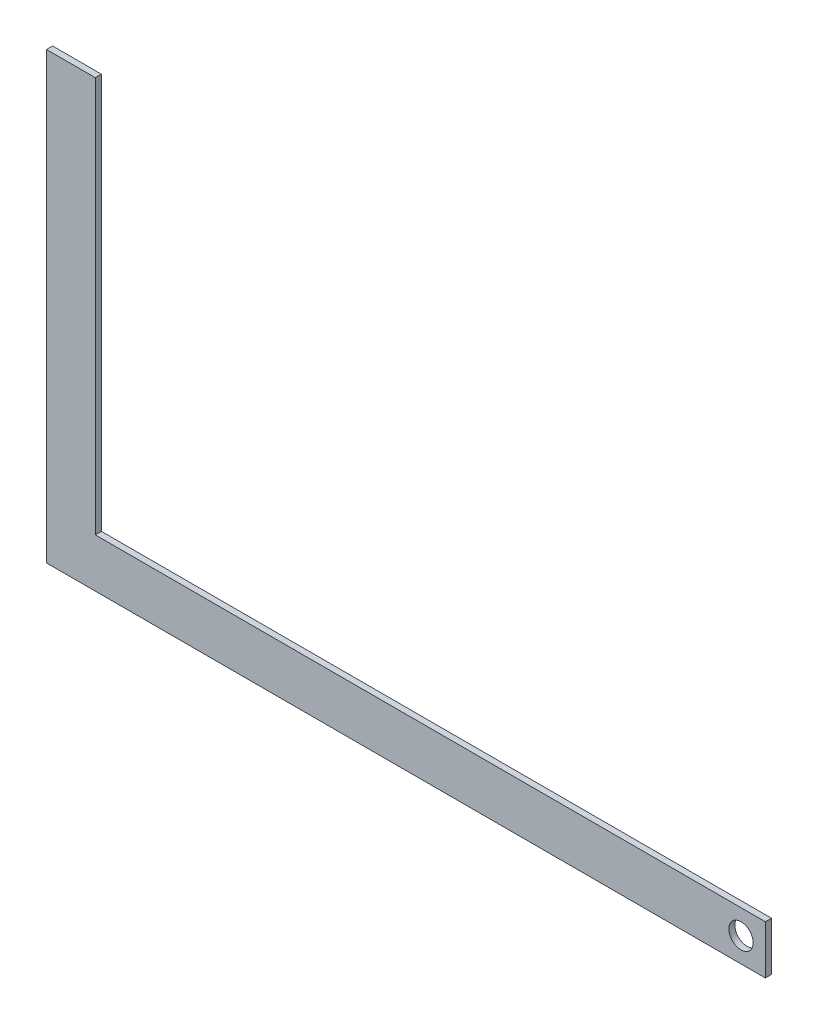
ISO-10303-21;
HEADER;
FILE_DESCRIPTION(('STEP AP214'),'2;1');
FILE_NAME('part.step','',(''),(''),'','','');
FILE_SCHEMA(('AUTOMOTIVE_DESIGN { 1 0 10303 214 1 1 1 1 }'));
ENDSEC;
DATA;
#1=APPLICATION_CONTEXT('core data for automotive mechanical design processes');
#2=APPLICATION_PROTOCOL_DEFINITION('international standard','automotive_design',2000,#1);
#3=PRODUCT_CONTEXT('',#1,'mechanical');
#4=PRODUCT('Part','Part','',(#3));
#5=PRODUCT_RELATED_PRODUCT_CATEGORY('part','',(#4));
#6=PRODUCT_DEFINITION_FORMATION('','',#4);
#7=PRODUCT_DEFINITION_CONTEXT('part definition',#1,'design');
#8=PRODUCT_DEFINITION('design','',#6,#7);
#9=PRODUCT_DEFINITION_SHAPE('','',#8);
#10=(LENGTH_UNIT() NAMED_UNIT(*) SI_UNIT(.MILLI.,.METRE.));
#11=(NAMED_UNIT(*) PLANE_ANGLE_UNIT() SI_UNIT($,.RADIAN.));
#12=(NAMED_UNIT(*) SI_UNIT($,.STERADIAN.) SOLID_ANGLE_UNIT());
#13=UNCERTAINTY_MEASURE_WITH_UNIT(LENGTH_MEASURE(1.E-05),#10,'distance_accuracy_value','');
#14=(GEOMETRIC_REPRESENTATION_CONTEXT(3) GLOBAL_UNCERTAINTY_ASSIGNED_CONTEXT((#13)) GLOBAL_UNIT_ASSIGNED_CONTEXT((#10,
#11,#12)) REPRESENTATION_CONTEXT('',''));
#15=CARTESIAN_POINT('',(0.,0.,0.));
#16=DIRECTION('',(0.,0.,1.));
#17=DIRECTION('',(1.,0.,0.));
#18=AXIS2_PLACEMENT_3D('',#15,#16,#17);
#19=CARTESIAN_POINT('',(0.,0.,3.175));
#20=DIRECTION('',(0.,0.,-1.));
#21=DIRECTION('',(-1.,0.,0.));
#22=AXIS2_PLACEMENT_3D('',#19,#20,#21);
#23=PLANE('',#22);
#24=DIRECTION('',(0.,-1.,0.));
#25=VECTOR('',#24,1.);
#26=CARTESIAN_POINT('',(0.,0.,3.175));
#27=LINE('',#26,#25);
#28=CARTESIAN_POINT('',(0.,231.775,3.175));
#29=VERTEX_POINT('',#28);
#30=CARTESIAN_POINT('',(0.,0.,3.175));
#31=VERTEX_POINT('',#30);
#32=EDGE_CURVE('E114',#29,#31,#27,.T.);
#33=ORIENTED_EDGE('',*,*,#32,.T.);
#34=DIRECTION('',(1.,0.,0.));
#35=VECTOR('',#34,1.);
#36=CARTESIAN_POINT('',(0.,0.,3.175));
#37=LINE('',#36,#35);
#38=CARTESIAN_POINT('',(374.65,0.,3.175));
#39=VERTEX_POINT('',#38);
#40=EDGE_CURVE('E78',#31,#39,#37,.T.);
#41=ORIENTED_EDGE('',*,*,#40,.T.);
#42=DIRECTION('',(0.,1.,0.));
#43=VECTOR('',#42,1.);
#44=CARTESIAN_POINT('',(374.65,0.,3.175));
#45=LINE('',#44,#43);
#46=CARTESIAN_POINT('',(374.65,25.4,3.175));
#47=VERTEX_POINT('',#46);
#48=EDGE_CURVE('E56',#39,#47,#45,.T.);
#49=ORIENTED_EDGE('',*,*,#48,.T.);
#50=DIRECTION('',(-1.,0.,0.));
#51=VECTOR('',#50,1.);
#52=CARTESIAN_POINT('',(0.,25.4,3.175));
#53=LINE('',#52,#51);
#54=CARTESIAN_POINT('',(25.4,25.4,3.175));
#55=VERTEX_POINT('',#54);
#56=EDGE_CURVE('E121',#47,#55,#53,.T.);
#57=ORIENTED_EDGE('',*,*,#56,.T.);
#58=DIRECTION('',(0.,1.,0.));
#59=VECTOR('',#58,1.);
#60=CARTESIAN_POINT('',(25.4,25.4,3.175));
#61=LINE('',#60,#59);
#62=CARTESIAN_POINT('',(25.4,231.775,3.175));
#63=VERTEX_POINT('',#62);
#64=EDGE_CURVE('E47',#55,#63,#61,.T.);
#65=ORIENTED_EDGE('',*,*,#64,.T.);
#66=DIRECTION('',(-1.,0.,0.));
#67=VECTOR('',#66,1.);
#68=CARTESIAN_POINT('',(0.,231.775,3.175));
#69=LINE('',#68,#67);
#70=EDGE_CURVE('E110',#63,#29,#69,.T.);
#71=ORIENTED_EDGE('',*,*,#70,.T.);
#72=EDGE_LOOP('',(#33,#41,#49,#57,#65,#71));
#73=FACE_BOUND('',#72,.T.);
#74=CARTESIAN_POINT('',(361.95,12.7,3.175));
#75=DIRECTION('',(0.,0.,1.));
#76=DIRECTION('',(1.,0.,0.));
#77=AXIS2_PLACEMENT_3D('',#74,#75,#76);
#78=CIRCLE('',#77,6.35);
#79=CARTESIAN_POINT('',(368.3,12.7,3.175));
#80=VERTEX_POINT('',#79);
#81=EDGE_CURVE('E131',#80,#80,#78,.T.);
#82=ORIENTED_EDGE('',*,*,#81,.F.);
#83=EDGE_LOOP('',(#82));
#84=FACE_BOUND('',#83,.T.);
#85=ADVANCED_FACE('F32',(#73,#84),#23,.F.);
#86=CARTESIAN_POINT('',(0.,0.,0.));
#87=DIRECTION('',(0.,0.,-1.));
#88=DIRECTION('',(-1.,0.,0.));
#89=AXIS2_PLACEMENT_3D('',#86,#87,#88);
#90=PLANE('',#89);
#91=DIRECTION('',(0.,-1.,0.));
#92=VECTOR('',#91,1.);
#93=CARTESIAN_POINT('',(0.,0.,0.));
#94=LINE('',#93,#92);
#95=CARTESIAN_POINT('',(0.,231.775,0.));
#96=VERTEX_POINT('',#95);
#97=CARTESIAN_POINT('',(0.,0.,0.));
#98=VERTEX_POINT('',#97);
#99=EDGE_CURVE('E124',#96,#98,#94,.T.);
#100=ORIENTED_EDGE('',*,*,#99,.F.);
#101=DIRECTION('',(-1.,0.,0.));
#102=VECTOR('',#101,1.);
#103=CARTESIAN_POINT('',(0.,231.775,0.));
#104=LINE('',#103,#102);
#105=CARTESIAN_POINT('',(25.4,231.775,0.));
#106=VERTEX_POINT('',#105);
#107=EDGE_CURVE('E102',#106,#96,#104,.T.);
#108=ORIENTED_EDGE('',*,*,#107,.F.);
#109=DIRECTION('',(0.,1.,0.));
#110=VECTOR('',#109,1.);
#111=CARTESIAN_POINT('',(25.4,25.4,0.));
#112=LINE('',#111,#110);
#113=CARTESIAN_POINT('',(25.4,25.4,0.));
#114=VERTEX_POINT('',#113);
#115=EDGE_CURVE('E96',#114,#106,#112,.T.);
#116=ORIENTED_EDGE('',*,*,#115,.F.);
#117=DIRECTION('',(-1.,0.,0.));
#118=VECTOR('',#117,1.);
#119=CARTESIAN_POINT('',(0.,25.4,0.));
#120=LINE('',#119,#118);
#121=CARTESIAN_POINT('',(374.65,25.4,0.));
#122=VERTEX_POINT('',#121);
#123=EDGE_CURVE('E108',#122,#114,#120,.T.);
#124=ORIENTED_EDGE('',*,*,#123,.F.);
#125=DIRECTION('',(0.,1.,0.));
#126=VECTOR('',#125,1.);
#127=CARTESIAN_POINT('',(374.65,0.,0.));
#128=LINE('',#127,#126);
#129=CARTESIAN_POINT('',(374.65,0.,0.));
#130=VERTEX_POINT('',#129);
#131=EDGE_CURVE('E73',#130,#122,#128,.T.);
#132=ORIENTED_EDGE('',*,*,#131,.F.);
#133=DIRECTION('',(1.,0.,0.));
#134=VECTOR('',#133,1.);
#135=CARTESIAN_POINT('',(0.,0.,0.));
#136=LINE('',#135,#134);
#137=EDGE_CURVE('E117',#98,#130,#136,.T.);
#138=ORIENTED_EDGE('',*,*,#137,.F.);
#139=EDGE_LOOP('',(#100,#108,#116,#124,#132,#138));
#140=FACE_BOUND('',#139,.T.);
#141=CARTESIAN_POINT('',(361.95,12.7,0.));
#142=DIRECTION('',(0.,0.,1.));
#143=DIRECTION('',(1.,0.,0.));
#144=AXIS2_PLACEMENT_3D('',#141,#142,#143);
#145=CIRCLE('',#144,6.35);
#146=CARTESIAN_POINT('',(368.3,12.7,0.));
#147=VERTEX_POINT('',#146);
#148=EDGE_CURVE('E134',#147,#147,#145,.T.);
#149=ORIENTED_EDGE('',*,*,#148,.T.);
#150=EDGE_LOOP('',(#149));
#151=FACE_BOUND('',#150,.T.);
#152=ADVANCED_FACE('F106',(#140,#151),#90,.T.);
#153=CARTESIAN_POINT('',(0.,0.,3.175));
#154=DIRECTION('',(1.,0.,0.));
#155=DIRECTION('',(0.,0.,-1.));
#156=AXIS2_PLACEMENT_3D('',#153,#154,#155);
#157=PLANE('',#156);
#158=ORIENTED_EDGE('',*,*,#99,.T.);
#159=DIRECTION('',(0.,0.,-1.));
#160=VECTOR('',#159,1.);
#161=CARTESIAN_POINT('',(0.,0.,3.175));
#162=LINE('',#161,#160);
#163=EDGE_CURVE('E11',#31,#98,#162,.T.);
#164=ORIENTED_EDGE('',*,*,#163,.F.);
#165=ORIENTED_EDGE('',*,*,#32,.F.);
#166=DIRECTION('',(0.,0.,1.));
#167=VECTOR('',#166,1.);
#168=CARTESIAN_POINT('',(0.,231.775,0.));
#169=LINE('',#168,#167);
#170=EDGE_CURVE('E130',#96,#29,#169,.T.);
#171=ORIENTED_EDGE('',*,*,#170,.F.);
#172=EDGE_LOOP('',(#158,#164,#165,#171));
#173=FACE_BOUND('',#172,.T.);
#174=ADVANCED_FACE('F34',(#173),#157,.F.);
#175=CARTESIAN_POINT('',(0.,0.,3.175));
#176=DIRECTION('',(0.,1.,0.));
#177=DIRECTION('',(0.,0.,1.));
#178=AXIS2_PLACEMENT_3D('',#175,#176,#177);
#179=PLANE('',#178);
#180=ORIENTED_EDGE('',*,*,#137,.T.);
#181=DIRECTION('',(0.,0.,-1.));
#182=VECTOR('',#181,1.);
#183=CARTESIAN_POINT('',(374.65,0.,3.175));
#184=LINE('',#183,#182);
#185=EDGE_CURVE('E40',#39,#130,#184,.T.);
#186=ORIENTED_EDGE('',*,*,#185,.F.);
#187=ORIENTED_EDGE('',*,*,#40,.F.);
#188=ORIENTED_EDGE('',*,*,#163,.T.);
#189=EDGE_LOOP('',(#180,#186,#187,#188));
#190=FACE_BOUND('',#189,.T.);
#191=ADVANCED_FACE('F127',(#190),#179,.F.);
#192=CARTESIAN_POINT('',(374.65,0.,3.175));
#193=DIRECTION('',(-1.,0.,0.));
#194=DIRECTION('',(0.,0.,1.));
#195=AXIS2_PLACEMENT_3D('',#192,#193,#194);
#196=PLANE('',#195);
#197=ORIENTED_EDGE('',*,*,#131,.T.);
#198=DIRECTION('',(0.,0.,-1.));
#199=VECTOR('',#198,1.);
#200=CARTESIAN_POINT('',(374.65,25.4,3.175));
#201=LINE('',#200,#199);
#202=EDGE_CURVE('E113',#47,#122,#201,.T.);
#203=ORIENTED_EDGE('',*,*,#202,.F.);
#204=ORIENTED_EDGE('',*,*,#48,.F.);
#205=ORIENTED_EDGE('',*,*,#185,.T.);
#206=EDGE_LOOP('',(#197,#203,#204,#205));
#207=FACE_BOUND('',#206,.T.);
#208=ADVANCED_FACE('F122',(#207),#196,.F.);
#209=CARTESIAN_POINT('',(0.,25.4,3.175));
#210=DIRECTION('',(0.,-1.,0.));
#211=DIRECTION('',(0.,0.,-1.));
#212=AXIS2_PLACEMENT_3D('',#209,#210,#211);
#213=PLANE('',#212);
#214=ORIENTED_EDGE('',*,*,#123,.T.);
#215=DIRECTION('',(0.,0.,1.));
#216=VECTOR('',#215,1.);
#217=CARTESIAN_POINT('',(25.4,25.4,0.));
#218=LINE('',#217,#216);
#219=EDGE_CURVE('E93',#114,#55,#218,.T.);
#220=ORIENTED_EDGE('',*,*,#219,.T.);
#221=ORIENTED_EDGE('',*,*,#56,.F.);
#222=ORIENTED_EDGE('',*,*,#202,.T.);
#223=EDGE_LOOP('',(#214,#220,#221,#222));
#224=FACE_BOUND('',#223,.T.);
#225=ADVANCED_FACE('F112',(#224),#213,.F.);
#226=CARTESIAN_POINT('',(361.95,12.7,3.175));
#227=DIRECTION('',(0.,0.,-1.));
#228=DIRECTION('',(-1.,0.,0.));
#229=AXIS2_PLACEMENT_3D('',#226,#227,#228);
#230=CYLINDRICAL_SURFACE('',#229,6.35);
#231=ORIENTED_EDGE('',*,*,#81,.T.);
#232=EDGE_LOOP('',(#231));
#233=FACE_BOUND('',#232,.T.);
#234=ORIENTED_EDGE('',*,*,#148,.F.);
#235=EDGE_LOOP('',(#234));
#236=FACE_BOUND('',#235,.T.);
#237=ADVANCED_FACE('F155',(#233,#236),#230,.F.);
#238=CARTESIAN_POINT('',(0.,231.775,0.));
#239=DIRECTION('',(0.,1.,0.));
#240=DIRECTION('',(0.,0.,1.));
#241=AXIS2_PLACEMENT_3D('',#238,#239,#240);
#242=PLANE('',#241);
#243=ORIENTED_EDGE('',*,*,#70,.F.);
#244=DIRECTION('',(0.,0.,1.));
#245=VECTOR('',#244,1.);
#246=CARTESIAN_POINT('',(25.4,231.775,0.));
#247=LINE('',#246,#245);
#248=EDGE_CURVE('E101',#106,#63,#247,.T.);
#249=ORIENTED_EDGE('',*,*,#248,.F.);
#250=ORIENTED_EDGE('',*,*,#107,.T.);
#251=ORIENTED_EDGE('',*,*,#170,.T.);
#252=EDGE_LOOP('',(#243,#249,#250,#251));
#253=FACE_BOUND('',#252,.T.);
#254=ADVANCED_FACE('F149',(#253),#242,.T.);
#255=CARTESIAN_POINT('',(25.4,25.4,0.));
#256=DIRECTION('',(1.,0.,0.));
#257=DIRECTION('',(0.,0.,-1.));
#258=AXIS2_PLACEMENT_3D('',#255,#256,#257);
#259=PLANE('',#258);
#260=ORIENTED_EDGE('',*,*,#64,.F.);
#261=ORIENTED_EDGE('',*,*,#219,.F.);
#262=ORIENTED_EDGE('',*,*,#115,.T.);
#263=ORIENTED_EDGE('',*,*,#248,.T.);
#264=EDGE_LOOP('',(#260,#261,#262,#263));
#265=FACE_BOUND('',#264,.T.);
#266=ADVANCED_FACE('F95',(#265),#259,.T.);
#267=CLOSED_SHELL('',(#85,#152,#174,#191,#208,#225,#237,#254,#266));
#268=MANIFOLD_SOLID_BREP('B2',#267);
#269=ADVANCED_BREP_SHAPE_REPRESENTATION('',(#18,#268),#14);
#270=SHAPE_DEFINITION_REPRESENTATION(#9,#269);
ENDSEC;
END-ISO-10303-21;
